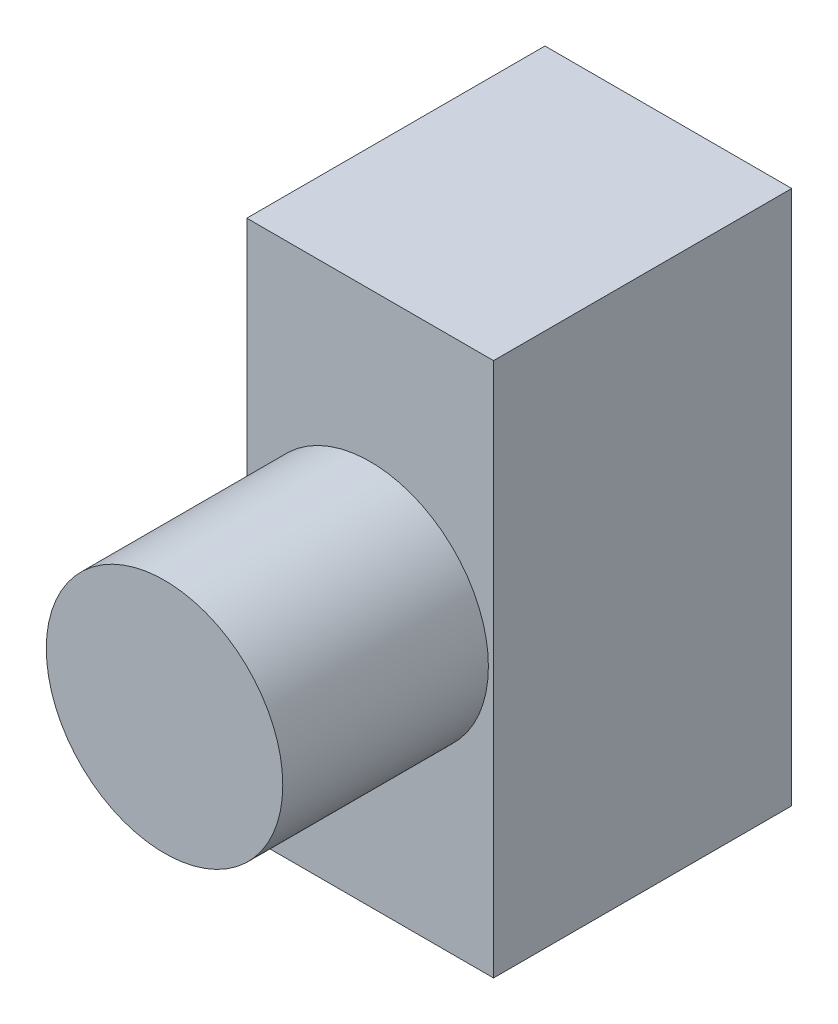
ISO-10303-21;
HEADER;
FILE_DESCRIPTION(('STEP AP214'),'2;1');
FILE_NAME('part.step','',(''),(''),'','','');
FILE_SCHEMA(('AUTOMOTIVE_DESIGN { 1 0 10303 214 1 1 1 1 }'));
ENDSEC;
DATA;
#1=APPLICATION_CONTEXT('core data for automotive mechanical design processes');
#2=APPLICATION_PROTOCOL_DEFINITION('international standard','automotive_design',2000,#1);
#3=PRODUCT_CONTEXT('',#1,'mechanical');
#4=PRODUCT('Part','Part','',(#3));
#5=PRODUCT_RELATED_PRODUCT_CATEGORY('part','',(#4));
#6=PRODUCT_DEFINITION_FORMATION('','',#4);
#7=PRODUCT_DEFINITION_CONTEXT('part definition',#1,'design');
#8=PRODUCT_DEFINITION('design','',#6,#7);
#9=PRODUCT_DEFINITION_SHAPE('','',#8);
#10=(LENGTH_UNIT() NAMED_UNIT(*) SI_UNIT(.MILLI.,.METRE.));
#11=(NAMED_UNIT(*) PLANE_ANGLE_UNIT() SI_UNIT($,.RADIAN.));
#12=(NAMED_UNIT(*) SI_UNIT($,.STERADIAN.) SOLID_ANGLE_UNIT());
#13=UNCERTAINTY_MEASURE_WITH_UNIT(LENGTH_MEASURE(1.E-05),#10,'distance_accuracy_value','');
#14=(GEOMETRIC_REPRESENTATION_CONTEXT(3) GLOBAL_UNCERTAINTY_ASSIGNED_CONTEXT((#13)) GLOBAL_UNIT_ASSIGNED_CONTEXT((#10,
#11,#12)) REPRESENTATION_CONTEXT('',''));
#15=CARTESIAN_POINT('',(0.,0.,0.));
#16=DIRECTION('',(0.,0.,1.));
#17=DIRECTION('',(1.,0.,0.));
#18=AXIS2_PLACEMENT_3D('',#15,#16,#17);
#19=CARTESIAN_POINT('',(-6.,13.,-14.5));
#20=DIRECTION('',(0.,-1.,0.));
#21=DIRECTION('',(1.,0.,0.));
#22=AXIS2_PLACEMENT_3D('',#19,#20,#21);
#23=PLANE('',#22);
#24=DIRECTION('',(1.,0.,0.));
#25=VECTOR('',#24,1.);
#26=CARTESIAN_POINT('',(-6.,13.,0.));
#27=LINE('',#26,#25);
#28=CARTESIAN_POINT('',(-6.,13.,0.));
#29=VERTEX_POINT('',#28);
#30=CARTESIAN_POINT('',(6.,13.,0.));
#31=VERTEX_POINT('',#30);
#32=EDGE_CURVE('E110',#29,#31,#27,.T.);
#33=ORIENTED_EDGE('',*,*,#32,.T.);
#34=DIRECTION('',(0.,0.,1.));
#35=VECTOR('',#34,1.);
#36=CARTESIAN_POINT('',(6.,13.,-14.5));
#37=LINE('',#36,#35);
#38=CARTESIAN_POINT('',(6.,13.,-14.5));
#39=VERTEX_POINT('',#38);
#40=EDGE_CURVE('E42',#39,#31,#37,.T.);
#41=ORIENTED_EDGE('',*,*,#40,.F.);
#42=DIRECTION('',(1.,0.,0.));
#43=VECTOR('',#42,1.);
#44=CARTESIAN_POINT('',(-6.,13.,-14.5));
#45=LINE('',#44,#43);
#46=CARTESIAN_POINT('',(-6.,13.,-14.5));
#47=VERTEX_POINT('',#46);
#48=EDGE_CURVE('E91',#47,#39,#45,.T.);
#49=ORIENTED_EDGE('',*,*,#48,.F.);
#50=DIRECTION('',(0.,0.,1.));
#51=VECTOR('',#50,1.);
#52=CARTESIAN_POINT('',(-6.,13.,-14.5));
#53=LINE('',#52,#51);
#54=EDGE_CURVE('E57',#47,#29,#53,.T.);
#55=ORIENTED_EDGE('',*,*,#54,.T.);
#56=EDGE_LOOP('',(#33,#41,#49,#55));
#57=FACE_BOUND('',#56,.T.);
#58=ADVANCED_FACE('F39',(#57),#23,.F.);
#59=CARTESIAN_POINT('',(6.,13.,-14.5));
#60=DIRECTION('',(-1.,0.,0.));
#61=DIRECTION('',(0.,0.,1.));
#62=AXIS2_PLACEMENT_3D('',#59,#60,#61);
#63=PLANE('',#62);
#64=DIRECTION('',(0.,-1.,0.));
#65=VECTOR('',#64,1.);
#66=CARTESIAN_POINT('',(6.,13.,0.));
#67=LINE('',#66,#65);
#68=CARTESIAN_POINT('',(6.,-13.,0.));
#69=VERTEX_POINT('',#68);
#70=EDGE_CURVE('E98',#31,#69,#67,.T.);
#71=ORIENTED_EDGE('',*,*,#70,.T.);
#72=DIRECTION('',(0.,0.,1.));
#73=VECTOR('',#72,1.);
#74=CARTESIAN_POINT('',(6.,-13.,-14.5));
#75=LINE('',#74,#73);
#76=CARTESIAN_POINT('',(6.,-13.,-14.5));
#77=VERTEX_POINT('',#76);
#78=EDGE_CURVE('E96',#77,#69,#75,.T.);
#79=ORIENTED_EDGE('',*,*,#78,.F.);
#80=DIRECTION('',(0.,-1.,0.));
#81=VECTOR('',#80,1.);
#82=CARTESIAN_POINT('',(6.,13.,-14.5));
#83=LINE('',#82,#81);
#84=EDGE_CURVE('E83',#39,#77,#83,.T.);
#85=ORIENTED_EDGE('',*,*,#84,.F.);
#86=ORIENTED_EDGE('',*,*,#40,.T.);
#87=EDGE_LOOP('',(#71,#79,#85,#86));
#88=FACE_BOUND('',#87,.T.);
#89=ADVANCED_FACE('F97',(#88),#63,.F.);
#90=CARTESIAN_POINT('',(-6.,-13.,-14.5));
#91=DIRECTION('',(0.,-1.,0.));
#92=DIRECTION('',(0.,0.,-1.));
#93=AXIS2_PLACEMENT_3D('',#90,#91,#92);
#94=PLANE('',#93);
#95=DIRECTION('',(1.,0.,0.));
#96=VECTOR('',#95,1.);
#97=CARTESIAN_POINT('',(-6.,-13.,0.));
#98=LINE('',#97,#96);
#99=CARTESIAN_POINT('',(-6.,-13.,0.));
#100=VERTEX_POINT('',#99);
#101=EDGE_CURVE('E116',#100,#69,#98,.T.);
#102=ORIENTED_EDGE('',*,*,#101,.F.);
#103=DIRECTION('',(0.,0.,1.));
#104=VECTOR('',#103,1.);
#105=CARTESIAN_POINT('',(-6.,-13.,-14.5));
#106=LINE('',#105,#104);
#107=CARTESIAN_POINT('',(-6.,-13.,-14.5));
#108=VERTEX_POINT('',#107);
#109=EDGE_CURVE('E71',#108,#100,#106,.T.);
#110=ORIENTED_EDGE('',*,*,#109,.F.);
#111=DIRECTION('',(1.,0.,0.));
#112=VECTOR('',#111,1.);
#113=CARTESIAN_POINT('',(-6.,-13.,-14.5));
#114=LINE('',#113,#112);
#115=EDGE_CURVE('E90',#108,#77,#114,.T.);
#116=ORIENTED_EDGE('',*,*,#115,.T.);
#117=ORIENTED_EDGE('',*,*,#78,.T.);
#118=EDGE_LOOP('',(#102,#110,#116,#117));
#119=FACE_BOUND('',#118,.T.);
#120=ADVANCED_FACE('F102',(#119),#94,.T.);
#121=CARTESIAN_POINT('',(-6.,13.,-14.5));
#122=DIRECTION('',(-1.,0.,0.));
#123=DIRECTION('',(0.,-1.,0.));
#124=AXIS2_PLACEMENT_3D('',#121,#122,#123);
#125=PLANE('',#124);
#126=DIRECTION('',(0.,-1.,0.));
#127=VECTOR('',#126,1.);
#128=CARTESIAN_POINT('',(-6.,13.,0.));
#129=LINE('',#128,#127);
#130=EDGE_CURVE('E119',#29,#100,#129,.T.);
#131=ORIENTED_EDGE('',*,*,#130,.F.);
#132=ORIENTED_EDGE('',*,*,#54,.F.);
#133=DIRECTION('',(0.,-1.,0.));
#134=VECTOR('',#133,1.);
#135=CARTESIAN_POINT('',(-6.,13.,-14.5));
#136=LINE('',#135,#134);
#137=EDGE_CURVE('E104',#47,#108,#136,.T.);
#138=ORIENTED_EDGE('',*,*,#137,.T.);
#139=ORIENTED_EDGE('',*,*,#109,.T.);
#140=EDGE_LOOP('',(#131,#132,#138,#139));
#141=FACE_BOUND('',#140,.T.);
#142=ADVANCED_FACE('F129',(#141),#125,.T.);
#143=CARTESIAN_POINT('',(0.,0.,-14.5));
#144=DIRECTION('',(0.,0.,-1.));
#145=DIRECTION('',(-1.,0.,0.));
#146=AXIS2_PLACEMENT_3D('',#143,#144,#145);
#147=PLANE('',#146);
#148=ORIENTED_EDGE('',*,*,#48,.T.);
#149=ORIENTED_EDGE('',*,*,#84,.T.);
#150=ORIENTED_EDGE('',*,*,#115,.F.);
#151=ORIENTED_EDGE('',*,*,#137,.F.);
#152=EDGE_LOOP('',(#148,#149,#150,#151));
#153=FACE_BOUND('',#152,.T.);
#154=ADVANCED_FACE('F87',(#153),#147,.T.);
#155=CARTESIAN_POINT('',(0.,0.,0.));
#156=DIRECTION('',(0.,0.,-1.));
#157=DIRECTION('',(-1.,0.,0.));
#158=AXIS2_PLACEMENT_3D('',#155,#156,#157);
#159=PLANE('',#158);
#160=CARTESIAN_POINT('',(0.,0.,0.));
#161=DIRECTION('',(0.,0.,1.));
#162=DIRECTION('',(1.,0.,0.));
#163=AXIS2_PLACEMENT_3D('',#160,#161,#162);
#164=CIRCLE('',#163,5.75);
#165=CARTESIAN_POINT('',(5.75,0.,0.));
#166=VERTEX_POINT('',#165);
#167=EDGE_CURVE('E11',#166,#166,#164,.T.);
#168=ORIENTED_EDGE('',*,*,#167,.F.);
#169=EDGE_LOOP('',(#168));
#170=FACE_BOUND('',#169,.T.);
#171=ORIENTED_EDGE('',*,*,#32,.F.);
#172=ORIENTED_EDGE('',*,*,#130,.T.);
#173=ORIENTED_EDGE('',*,*,#101,.T.);
#174=ORIENTED_EDGE('',*,*,#70,.F.);
#175=EDGE_LOOP('',(#171,#172,#173,#174));
#176=FACE_BOUND('',#175,.T.);
#177=ADVANCED_FACE('F128',(#170,#176),#159,.F.);
#178=CARTESIAN_POINT('',(0.,0.,10.));
#179=DIRECTION('',(0.,0.,-1.));
#180=DIRECTION('',(-1.,0.,0.));
#181=AXIS2_PLACEMENT_3D('',#178,#179,#180);
#182=CYLINDRICAL_SURFACE('',#181,5.75);
#183=CARTESIAN_POINT('',(0.,0.,10.));
#184=DIRECTION('',(0.,0.,1.));
#185=DIRECTION('',(1.,0.,0.));
#186=AXIS2_PLACEMENT_3D('',#183,#184,#185);
#187=CIRCLE('',#186,5.75);
#188=CARTESIAN_POINT('',(5.75,0.,10.));
#189=VERTEX_POINT('',#188);
#190=EDGE_CURVE('E113',#189,#189,#187,.T.);
#191=ORIENTED_EDGE('',*,*,#190,.F.);
#192=EDGE_LOOP('',(#191));
#193=FACE_BOUND('',#192,.T.);
#194=ORIENTED_EDGE('',*,*,#167,.T.);
#195=EDGE_LOOP('',(#194));
#196=FACE_BOUND('',#195,.T.);
#197=ADVANCED_FACE('F168',(#193,#196),#182,.T.);
#198=CARTESIAN_POINT('',(0.,0.,10.));
#199=DIRECTION('',(0.,0.,1.));
#200=DIRECTION('',(1.,0.,0.));
#201=AXIS2_PLACEMENT_3D('',#198,#199,#200);
#202=PLANE('',#201);
#203=ORIENTED_EDGE('',*,*,#190,.T.);
#204=EDGE_LOOP('',(#203));
#205=FACE_BOUND('',#204,.T.);
#206=ADVANCED_FACE('F177',(#205),#202,.T.);
#207=CLOSED_SHELL('',(#58,#89,#120,#142,#154,#177,#197,#206));
#208=MANIFOLD_SOLID_BREP('B2',#207);
#209=ADVANCED_BREP_SHAPE_REPRESENTATION('',(#18,#208),#14);
#210=SHAPE_DEFINITION_REPRESENTATION(#9,#209);
ENDSEC;
END-ISO-10303-21;
